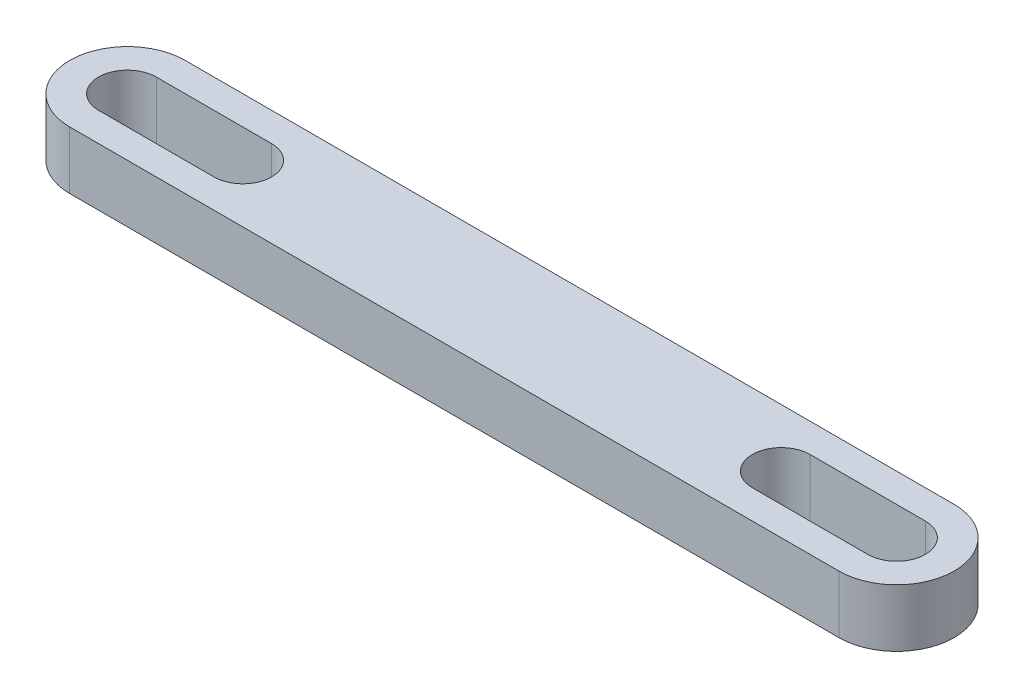
ISO-10303-21;
HEADER;
FILE_DESCRIPTION(('STEP AP214'),'2;1');
FILE_NAME('part.step','',(''),(''),'','','');
FILE_SCHEMA(('AUTOMOTIVE_DESIGN { 1 0 10303 214 1 1 1 1 }'));
ENDSEC;
DATA;
#1=APPLICATION_CONTEXT('core data for automotive mechanical design processes');
#2=APPLICATION_PROTOCOL_DEFINITION('international standard','automotive_design',2000,#1);
#3=PRODUCT_CONTEXT('',#1,'mechanical');
#4=PRODUCT('Part','Part','',(#3));
#5=PRODUCT_RELATED_PRODUCT_CATEGORY('part','',(#4));
#6=PRODUCT_DEFINITION_FORMATION('','',#4);
#7=PRODUCT_DEFINITION_CONTEXT('part definition',#1,'design');
#8=PRODUCT_DEFINITION('design','',#6,#7);
#9=PRODUCT_DEFINITION_SHAPE('','',#8);
#10=(LENGTH_UNIT() NAMED_UNIT(*) SI_UNIT(.MILLI.,.METRE.));
#11=(NAMED_UNIT(*) PLANE_ANGLE_UNIT() SI_UNIT($,.RADIAN.));
#12=(NAMED_UNIT(*) SI_UNIT($,.STERADIAN.) SOLID_ANGLE_UNIT());
#13=UNCERTAINTY_MEASURE_WITH_UNIT(LENGTH_MEASURE(1.E-05),#10,'distance_accuracy_value','');
#14=(GEOMETRIC_REPRESENTATION_CONTEXT(3) GLOBAL_UNCERTAINTY_ASSIGNED_CONTEXT((#13)) GLOBAL_UNIT_ASSIGNED_CONTEXT((#10,
#11,#12)) REPRESENTATION_CONTEXT('',''));
#15=CARTESIAN_POINT('',(0.,0.,0.));
#16=DIRECTION('',(0.,0.,1.));
#17=DIRECTION('',(1.,0.,0.));
#18=AXIS2_PLACEMENT_3D('',#15,#16,#17);
#19=CARTESIAN_POINT('',(0.,3.,-3.));
#20=DIRECTION('',(0.,-1.,0.));
#21=DIRECTION('',(0.,0.,-1.));
#22=AXIS2_PLACEMENT_3D('',#19,#20,#21);
#23=PLANE('',#22);
#24=DIRECTION('',(1.,0.,0.));
#25=VECTOR('',#24,1.);
#26=CARTESIAN_POINT('',(0.,3.,-1.49999999999999));
#27=LINE('',#26,#25);
#28=CARTESIAN_POINT('',(-40.,3.,-1.49999999999999));
#29=VERTEX_POINT('',#28);
#30=CARTESIAN_POINT('',(-34.,3.,-1.49999999999999));
#31=VERTEX_POINT('',#30);
#32=EDGE_CURVE('E206',#29,#31,#27,.T.);
#33=ORIENTED_EDGE('',*,*,#32,.F.);
#34=CARTESIAN_POINT('',(-40.,3.,-3.));
#35=DIRECTION('',(0.,1.,0.));
#36=DIRECTION('',(0.,0.,1.));
#37=AXIS2_PLACEMENT_3D('',#34,#35,#36);
#38=CIRCLE('',#37,1.5);
#39=CARTESIAN_POINT('',(-40.,3.,-4.5));
#40=VERTEX_POINT('',#39);
#41=EDGE_CURVE('E214',#40,#29,#38,.T.);
#42=ORIENTED_EDGE('',*,*,#41,.F.);
#43=DIRECTION('',(1.,0.,0.));
#44=VECTOR('',#43,1.);
#45=CARTESIAN_POINT('',(0.,3.,-4.49999999999998));
#46=LINE('',#45,#44);
#47=CARTESIAN_POINT('',(-34.,3.,-4.5));
#48=VERTEX_POINT('',#47);
#49=EDGE_CURVE('E211',#40,#48,#46,.T.);
#50=ORIENTED_EDGE('',*,*,#49,.T.);
#51=CARTESIAN_POINT('',(-34.,3.,-2.99999999999999));
#52=DIRECTION('',(0.,1.,0.));
#53=DIRECTION('',(0.,0.,1.));
#54=AXIS2_PLACEMENT_3D('',#51,#52,#53);
#55=CIRCLE('',#54,1.5);
#56=EDGE_CURVE('E208',#31,#48,#55,.T.);
#57=ORIENTED_EDGE('',*,*,#56,.F.);
#58=EDGE_LOOP('',(#33,#42,#50,#57));
#59=FACE_BOUND('',#58,.T.);
#60=CARTESIAN_POINT('',(0.,3.,-3.));
#61=DIRECTION('',(0.,-1.,0.));
#62=DIRECTION('',(0.,0.,-1.));
#63=AXIS2_PLACEMENT_3D('',#60,#61,#62);
#64=CIRCLE('',#63,3.);
#65=CARTESIAN_POINT('',(0.,3.,-6.));
#66=VERTEX_POINT('',#65);
#67=CARTESIAN_POINT('',(0.,3.,0.));
#68=VERTEX_POINT('',#67);
#69=EDGE_CURVE('E237',#66,#68,#64,.T.);
#70=ORIENTED_EDGE('',*,*,#69,.F.);
#71=DIRECTION('',(-1.,0.,0.));
#72=VECTOR('',#71,1.);
#73=CARTESIAN_POINT('',(0.,3.,-6.));
#74=LINE('',#73,#72);
#75=CARTESIAN_POINT('',(-40.,3.,-5.99999999999999));
#76=VERTEX_POINT('',#75);
#77=EDGE_CURVE('E246',#66,#76,#74,.T.);
#78=ORIENTED_EDGE('',*,*,#77,.T.);
#79=CARTESIAN_POINT('',(-40.,3.,-3.));
#80=DIRECTION('',(0.,1.,0.));
#81=DIRECTION('',(0.,0.,1.));
#82=AXIS2_PLACEMENT_3D('',#79,#80,#81);
#83=CIRCLE('',#82,3.);
#84=CARTESIAN_POINT('',(-40.,3.,0.));
#85=VERTEX_POINT('',#84);
#86=EDGE_CURVE('E244',#76,#85,#83,.T.);
#87=ORIENTED_EDGE('',*,*,#86,.T.);
#88=DIRECTION('',(-1.,0.,0.));
#89=VECTOR('',#88,1.);
#90=CARTESIAN_POINT('',(0.,3.,0.));
#91=LINE('',#90,#89);
#92=EDGE_CURVE('E240',#68,#85,#91,.T.);
#93=ORIENTED_EDGE('',*,*,#92,.F.);
#94=EDGE_LOOP('',(#70,#78,#87,#93));
#95=FACE_BOUND('',#94,.T.);
#96=DIRECTION('',(-1.,0.,0.));
#97=VECTOR('',#96,1.);
#98=CARTESIAN_POINT('',(0.,3.,-4.5));
#99=LINE('',#98,#97);
#100=CARTESIAN_POINT('',(0.,3.,-4.5));
#101=VERTEX_POINT('',#100);
#102=CARTESIAN_POINT('',(-6.,3.,-4.50000000000001));
#103=VERTEX_POINT('',#102);
#104=EDGE_CURVE('E171',#101,#103,#99,.T.);
#105=ORIENTED_EDGE('',*,*,#104,.F.);
#106=CARTESIAN_POINT('',(0.,3.,-3.));
#107=DIRECTION('',(0.,1.,0.));
#108=DIRECTION('',(0.,0.,1.));
#109=AXIS2_PLACEMENT_3D('',#106,#107,#108);
#110=CIRCLE('',#109,1.5);
#111=CARTESIAN_POINT('',(0.,3.,-1.49999999999999));
#112=VERTEX_POINT('',#111);
#113=EDGE_CURVE('E191',#101,#112,#110,.F.);
#114=ORIENTED_EDGE('',*,*,#113,.T.);
#115=DIRECTION('',(-1.,0.,0.));
#116=VECTOR('',#115,1.);
#117=CARTESIAN_POINT('',(0.,3.,-1.49999999999999));
#118=LINE('',#117,#116);
#119=CARTESIAN_POINT('',(-6.,3.,-1.5));
#120=VERTEX_POINT('',#119);
#121=EDGE_CURVE('E98',#112,#120,#118,.T.);
#122=ORIENTED_EDGE('',*,*,#121,.T.);
#123=CARTESIAN_POINT('',(-6.,3.,-3.00000000000001));
#124=DIRECTION('',(0.,1.,0.));
#125=DIRECTION('',(0.,0.,1.));
#126=AXIS2_PLACEMENT_3D('',#123,#124,#125);
#127=CIRCLE('',#126,1.50000000000001);
#128=EDGE_CURVE('E180',#103,#120,#127,.T.);
#129=ORIENTED_EDGE('',*,*,#128,.F.);
#130=EDGE_LOOP('',(#105,#114,#122,#129));
#131=FACE_BOUND('',#130,.T.);
#132=ADVANCED_FACE('F81',(#59,#95,#131),#23,.F.);
#133=CARTESIAN_POINT('',(0.,0.,-3.));
#134=DIRECTION('',(0.,-1.,0.));
#135=DIRECTION('',(0.,0.,-1.));
#136=AXIS2_PLACEMENT_3D('',#133,#134,#135);
#137=PLANE('',#136);
#138=CARTESIAN_POINT('',(0.,0.,-3.));
#139=DIRECTION('',(0.,-1.,0.));
#140=DIRECTION('',(0.,0.,-1.));
#141=AXIS2_PLACEMENT_3D('',#138,#139,#140);
#142=CIRCLE('',#141,3.);
#143=CARTESIAN_POINT('',(0.,0.,-6.));
#144=VERTEX_POINT('',#143);
#145=CARTESIAN_POINT('',(0.,0.,0.));
#146=VERTEX_POINT('',#145);
#147=EDGE_CURVE('E236',#144,#146,#142,.T.);
#148=ORIENTED_EDGE('',*,*,#147,.T.);
#149=DIRECTION('',(-1.,0.,0.));
#150=VECTOR('',#149,1.);
#151=CARTESIAN_POINT('',(0.,0.,0.));
#152=LINE('',#151,#150);
#153=CARTESIAN_POINT('',(-40.,0.,0.));
#154=VERTEX_POINT('',#153);
#155=EDGE_CURVE('E250',#146,#154,#152,.T.);
#156=ORIENTED_EDGE('',*,*,#155,.T.);
#157=CARTESIAN_POINT('',(-40.,0.,-3.));
#158=DIRECTION('',(0.,1.,0.));
#159=DIRECTION('',(0.,0.,1.));
#160=AXIS2_PLACEMENT_3D('',#157,#158,#159);
#161=CIRCLE('',#160,3.);
#162=CARTESIAN_POINT('',(-40.,0.,-5.99999999999999));
#163=VERTEX_POINT('',#162);
#164=EDGE_CURVE('E253',#163,#154,#161,.T.);
#165=ORIENTED_EDGE('',*,*,#164,.F.);
#166=DIRECTION('',(-1.,0.,0.));
#167=VECTOR('',#166,1.);
#168=CARTESIAN_POINT('',(0.,0.,-6.));
#169=LINE('',#168,#167);
#170=EDGE_CURVE('E241',#144,#163,#169,.T.);
#171=ORIENTED_EDGE('',*,*,#170,.F.);
#172=EDGE_LOOP('',(#148,#156,#165,#171));
#173=FACE_BOUND('',#172,.T.);
#174=CARTESIAN_POINT('',(-40.,0.,-3.));
#175=DIRECTION('',(0.,1.,0.));
#176=DIRECTION('',(0.,0.,1.));
#177=AXIS2_PLACEMENT_3D('',#174,#175,#176);
#178=CIRCLE('',#177,1.5);
#179=CARTESIAN_POINT('',(-40.,0.,-4.5));
#180=VERTEX_POINT('',#179);
#181=CARTESIAN_POINT('',(-40.,0.,-1.49999999999999));
#182=VERTEX_POINT('',#181);
#183=EDGE_CURVE('E209',#180,#182,#178,.T.);
#184=ORIENTED_EDGE('',*,*,#183,.T.);
#185=DIRECTION('',(1.,0.,0.));
#186=VECTOR('',#185,1.);
#187=CARTESIAN_POINT('',(0.,0.,-1.49999999999999));
#188=LINE('',#187,#186);
#189=CARTESIAN_POINT('',(-34.,0.,-1.49999999999999));
#190=VERTEX_POINT('',#189);
#191=EDGE_CURVE('E187',#182,#190,#188,.T.);
#192=ORIENTED_EDGE('',*,*,#191,.T.);
#193=CARTESIAN_POINT('',(-34.,0.,-2.99999999999999));
#194=DIRECTION('',(0.,1.,0.));
#195=DIRECTION('',(0.,0.,1.));
#196=AXIS2_PLACEMENT_3D('',#193,#194,#195);
#197=CIRCLE('',#196,1.5);
#198=CARTESIAN_POINT('',(-34.,0.,-4.5));
#199=VERTEX_POINT('',#198);
#200=EDGE_CURVE('E219',#190,#199,#197,.T.);
#201=ORIENTED_EDGE('',*,*,#200,.T.);
#202=DIRECTION('',(1.,0.,0.));
#203=VECTOR('',#202,1.);
#204=CARTESIAN_POINT('',(0.,0.,-4.49999999999998));
#205=LINE('',#204,#203);
#206=EDGE_CURVE('E222',#180,#199,#205,.T.);
#207=ORIENTED_EDGE('',*,*,#206,.F.);
#208=EDGE_LOOP('',(#184,#192,#201,#207));
#209=FACE_BOUND('',#208,.T.);
#210=CARTESIAN_POINT('',(0.,0.,-3.));
#211=DIRECTION('',(0.,1.,0.));
#212=DIRECTION('',(0.,0.,1.));
#213=AXIS2_PLACEMENT_3D('',#210,#211,#212);
#214=CIRCLE('',#213,1.5);
#215=CARTESIAN_POINT('',(0.,0.,-4.5));
#216=VERTEX_POINT('',#215);
#217=CARTESIAN_POINT('',(0.,0.,-1.49999999999999));
#218=VERTEX_POINT('',#217);
#219=EDGE_CURVE('E181',#216,#218,#214,.F.);
#220=ORIENTED_EDGE('',*,*,#219,.F.);
#221=DIRECTION('',(-1.,0.,0.));
#222=VECTOR('',#221,1.);
#223=CARTESIAN_POINT('',(0.,0.,-4.5));
#224=LINE('',#223,#222);
#225=CARTESIAN_POINT('',(-6.,0.,-4.50000000000001));
#226=VERTEX_POINT('',#225);
#227=EDGE_CURVE('E106',#216,#226,#224,.T.);
#228=ORIENTED_EDGE('',*,*,#227,.T.);
#229=CARTESIAN_POINT('',(-6.,0.,-3.00000000000001));
#230=DIRECTION('',(0.,1.,0.));
#231=DIRECTION('',(0.,0.,1.));
#232=AXIS2_PLACEMENT_3D('',#229,#230,#231);
#233=CIRCLE('',#232,1.50000000000001);
#234=CARTESIAN_POINT('',(-6.,0.,-1.5));
#235=VERTEX_POINT('',#234);
#236=EDGE_CURVE('E186',#226,#235,#233,.T.);
#237=ORIENTED_EDGE('',*,*,#236,.T.);
#238=DIRECTION('',(-1.,0.,0.));
#239=VECTOR('',#238,1.);
#240=CARTESIAN_POINT('',(0.,0.,-1.49999999999999));
#241=LINE('',#240,#239);
#242=EDGE_CURVE('E197',#218,#235,#241,.T.);
#243=ORIENTED_EDGE('',*,*,#242,.F.);
#244=EDGE_LOOP('',(#220,#228,#237,#243));
#245=FACE_BOUND('',#244,.T.);
#246=ADVANCED_FACE('F270',(#173,#209,#245),#137,.T.);
#247=CARTESIAN_POINT('',(0.,3.,-3.));
#248=DIRECTION('',(0.,-1.,0.));
#249=DIRECTION('',(0.,0.,-1.));
#250=AXIS2_PLACEMENT_3D('',#247,#248,#249);
#251=CYLINDRICAL_SURFACE('',#250,3.);
#252=ORIENTED_EDGE('',*,*,#147,.F.);
#253=DIRECTION('',(0.,-1.,0.));
#254=VECTOR('',#253,1.);
#255=CARTESIAN_POINT('',(0.,3.,-6.));
#256=LINE('',#255,#254);
#257=EDGE_CURVE('E12',#66,#144,#256,.T.);
#258=ORIENTED_EDGE('',*,*,#257,.F.);
#259=ORIENTED_EDGE('',*,*,#69,.T.);
#260=DIRECTION('',(0.,-1.,0.));
#261=VECTOR('',#260,1.);
#262=CARTESIAN_POINT('',(0.,3.,0.));
#263=LINE('',#262,#261);
#264=EDGE_CURVE('E85',#68,#146,#263,.T.);
#265=ORIENTED_EDGE('',*,*,#264,.T.);
#266=EDGE_LOOP('',(#252,#258,#259,#265));
#267=FACE_BOUND('',#266,.T.);
#268=ADVANCED_FACE('F83',(#267),#251,.T.);
#269=CARTESIAN_POINT('',(0.,3.,-6.));
#270=DIRECTION('',(0.,0.,1.));
#271=DIRECTION('',(1.,0.,0.));
#272=AXIS2_PLACEMENT_3D('',#269,#270,#271);
#273=PLANE('',#272);
#274=ORIENTED_EDGE('',*,*,#170,.T.);
#275=DIRECTION('',(0.,-1.,0.));
#276=VECTOR('',#275,1.);
#277=CARTESIAN_POINT('',(-40.,3.,-5.99999999999999));
#278=LINE('',#277,#276);
#279=EDGE_CURVE('E90',#76,#163,#278,.T.);
#280=ORIENTED_EDGE('',*,*,#279,.F.);
#281=ORIENTED_EDGE('',*,*,#77,.F.);
#282=ORIENTED_EDGE('',*,*,#257,.T.);
#283=EDGE_LOOP('',(#274,#280,#281,#282));
#284=FACE_BOUND('',#283,.T.);
#285=ADVANCED_FACE('F274',(#284),#273,.F.);
#286=CARTESIAN_POINT('',(-40.,3.,-3.));
#287=DIRECTION('',(0.,-1.,0.));
#288=DIRECTION('',(0.,0.,-1.));
#289=AXIS2_PLACEMENT_3D('',#286,#287,#288);
#290=CYLINDRICAL_SURFACE('',#289,3.);
#291=ORIENTED_EDGE('',*,*,#164,.T.);
#292=DIRECTION('',(0.,-1.,0.));
#293=VECTOR('',#292,1.);
#294=CARTESIAN_POINT('',(-40.,3.,0.));
#295=LINE('',#294,#293);
#296=EDGE_CURVE('E258',#85,#154,#295,.T.);
#297=ORIENTED_EDGE('',*,*,#296,.F.);
#298=ORIENTED_EDGE('',*,*,#86,.F.);
#299=ORIENTED_EDGE('',*,*,#279,.T.);
#300=EDGE_LOOP('',(#291,#297,#298,#299));
#301=FACE_BOUND('',#300,.T.);
#302=ADVANCED_FACE('F278',(#301),#290,.T.);
#303=CARTESIAN_POINT('',(0.,3.,0.));
#304=DIRECTION('',(0.,0.,1.));
#305=DIRECTION('',(1.,0.,0.));
#306=AXIS2_PLACEMENT_3D('',#303,#304,#305);
#307=PLANE('',#306);
#308=ORIENTED_EDGE('',*,*,#155,.F.);
#309=ORIENTED_EDGE('',*,*,#264,.F.);
#310=ORIENTED_EDGE('',*,*,#92,.T.);
#311=ORIENTED_EDGE('',*,*,#296,.T.);
#312=EDGE_LOOP('',(#308,#309,#310,#311));
#313=FACE_BOUND('',#312,.T.);
#314=ADVANCED_FACE('F266',(#313),#307,.T.);
#315=CARTESIAN_POINT('',(0.,3.,-1.49999999999999));
#316=DIRECTION('',(0.,0.,-1.));
#317=DIRECTION('',(-1.,0.,0.));
#318=AXIS2_PLACEMENT_3D('',#315,#316,#317);
#319=PLANE('',#318);
#320=ORIENTED_EDGE('',*,*,#191,.F.);
#321=DIRECTION('',(0.,-1.,0.));
#322=VECTOR('',#321,1.);
#323=CARTESIAN_POINT('',(-40.,3.,-1.49999999999999));
#324=LINE('',#323,#322);
#325=EDGE_CURVE('E216',#29,#182,#324,.T.);
#326=ORIENTED_EDGE('',*,*,#325,.F.);
#327=ORIENTED_EDGE('',*,*,#32,.T.);
#328=DIRECTION('',(0.,-1.,0.));
#329=VECTOR('',#328,1.);
#330=CARTESIAN_POINT('',(-34.,3.,-1.49999999999999));
#331=LINE('',#330,#329);
#332=EDGE_CURVE('E233',#31,#190,#331,.T.);
#333=ORIENTED_EDGE('',*,*,#332,.T.);
#334=EDGE_LOOP('',(#320,#326,#327,#333));
#335=FACE_BOUND('',#334,.T.);
#336=ADVANCED_FACE('F289',(#335),#319,.T.);
#337=CARTESIAN_POINT('',(-34.,3.,-2.99999999999999));
#338=DIRECTION('',(0.,-1.,0.));
#339=DIRECTION('',(0.,0.,-1.));
#340=AXIS2_PLACEMENT_3D('',#337,#338,#339);
#341=CYLINDRICAL_SURFACE('',#340,1.5);
#342=ORIENTED_EDGE('',*,*,#200,.F.);
#343=ORIENTED_EDGE('',*,*,#332,.F.);
#344=ORIENTED_EDGE('',*,*,#56,.T.);
#345=DIRECTION('',(0.,-1.,0.));
#346=VECTOR('',#345,1.);
#347=CARTESIAN_POINT('',(-34.,3.,-4.5));
#348=LINE('',#347,#346);
#349=EDGE_CURVE('E231',#48,#199,#348,.T.);
#350=ORIENTED_EDGE('',*,*,#349,.T.);
#351=EDGE_LOOP('',(#342,#343,#344,#350));
#352=FACE_BOUND('',#351,.T.);
#353=ADVANCED_FACE('F299',(#352),#341,.F.);
#354=CARTESIAN_POINT('',(0.,3.,-4.49999999999998));
#355=DIRECTION('',(0.,0.,-1.));
#356=DIRECTION('',(-1.,0.,0.));
#357=AXIS2_PLACEMENT_3D('',#354,#355,#356);
#358=PLANE('',#357);
#359=ORIENTED_EDGE('',*,*,#206,.T.);
#360=ORIENTED_EDGE('',*,*,#349,.F.);
#361=ORIENTED_EDGE('',*,*,#49,.F.);
#362=DIRECTION('',(0.,-1.,0.));
#363=VECTOR('',#362,1.);
#364=CARTESIAN_POINT('',(-40.,3.,-4.5));
#365=LINE('',#364,#363);
#366=EDGE_CURVE('E229',#40,#180,#365,.T.);
#367=ORIENTED_EDGE('',*,*,#366,.T.);
#368=EDGE_LOOP('',(#359,#360,#361,#367));
#369=FACE_BOUND('',#368,.T.);
#370=ADVANCED_FACE('F304',(#369),#358,.F.);
#371=CARTESIAN_POINT('',(-40.,3.,-3.));
#372=DIRECTION('',(0.,-1.,0.));
#373=DIRECTION('',(0.,0.,-1.));
#374=AXIS2_PLACEMENT_3D('',#371,#372,#373);
#375=CYLINDRICAL_SURFACE('',#374,1.5);
#376=ORIENTED_EDGE('',*,*,#183,.F.);
#377=ORIENTED_EDGE('',*,*,#366,.F.);
#378=ORIENTED_EDGE('',*,*,#41,.T.);
#379=ORIENTED_EDGE('',*,*,#325,.T.);
#380=EDGE_LOOP('',(#376,#377,#378,#379));
#381=FACE_BOUND('',#380,.T.);
#382=ADVANCED_FACE('F310',(#381),#375,.F.);
#383=CARTESIAN_POINT('',(0.,3.,-4.5));
#384=DIRECTION('',(0.,0.,1.));
#385=DIRECTION('',(1.,0.,0.));
#386=AXIS2_PLACEMENT_3D('',#383,#384,#385);
#387=PLANE('',#386);
#388=ORIENTED_EDGE('',*,*,#227,.F.);
#389=DIRECTION('',(0.,-1.,0.));
#390=VECTOR('',#389,1.);
#391=CARTESIAN_POINT('',(0.,3.,-4.5));
#392=LINE('',#391,#390);
#393=EDGE_CURVE('E175',#101,#216,#392,.T.);
#394=ORIENTED_EDGE('',*,*,#393,.F.);
#395=ORIENTED_EDGE('',*,*,#104,.T.);
#396=DIRECTION('',(0.,-1.,0.));
#397=VECTOR('',#396,1.);
#398=CARTESIAN_POINT('',(-6.,3.,-4.50000000000001));
#399=LINE('',#398,#397);
#400=EDGE_CURVE('E174',#103,#226,#399,.T.);
#401=ORIENTED_EDGE('',*,*,#400,.T.);
#402=EDGE_LOOP('',(#388,#394,#395,#401));
#403=FACE_BOUND('',#402,.T.);
#404=ADVANCED_FACE('F173',(#403),#387,.T.);
#405=CARTESIAN_POINT('',(-6.,3.,-3.00000000000001));
#406=DIRECTION('',(0.,-1.,0.));
#407=DIRECTION('',(0.,0.,-1.));
#408=AXIS2_PLACEMENT_3D('',#405,#406,#407);
#409=CYLINDRICAL_SURFACE('',#408,1.50000000000001);
#410=ORIENTED_EDGE('',*,*,#236,.F.);
#411=ORIENTED_EDGE('',*,*,#400,.F.);
#412=ORIENTED_EDGE('',*,*,#128,.T.);
#413=DIRECTION('',(0.,-1.,0.));
#414=VECTOR('',#413,1.);
#415=CARTESIAN_POINT('',(-6.,3.,-1.5));
#416=LINE('',#415,#414);
#417=EDGE_CURVE('E188',#120,#235,#416,.T.);
#418=ORIENTED_EDGE('',*,*,#417,.T.);
#419=EDGE_LOOP('',(#410,#411,#412,#418));
#420=FACE_BOUND('',#419,.T.);
#421=ADVANCED_FACE('F184',(#420),#409,.F.);
#422=CARTESIAN_POINT('',(0.,3.,-1.49999999999999));
#423=DIRECTION('',(0.,0.,1.));
#424=DIRECTION('',(1.,0.,0.));
#425=AXIS2_PLACEMENT_3D('',#422,#423,#424);
#426=PLANE('',#425);
#427=ORIENTED_EDGE('',*,*,#242,.T.);
#428=ORIENTED_EDGE('',*,*,#417,.F.);
#429=ORIENTED_EDGE('',*,*,#121,.F.);
#430=DIRECTION('',(0.,-1.,0.));
#431=VECTOR('',#430,1.);
#432=CARTESIAN_POINT('',(0.,3.,-1.49999999999999));
#433=LINE('',#432,#431);
#434=EDGE_CURVE('E203',#112,#218,#433,.T.);
#435=ORIENTED_EDGE('',*,*,#434,.T.);
#436=EDGE_LOOP('',(#427,#428,#429,#435));
#437=FACE_BOUND('',#436,.T.);
#438=ADVANCED_FACE('F329',(#437),#426,.F.);
#439=CARTESIAN_POINT('',(0.,3.,-3.));
#440=DIRECTION('',(0.,-1.,0.));
#441=DIRECTION('',(0.,0.,-1.));
#442=AXIS2_PLACEMENT_3D('',#439,#440,#441);
#443=CYLINDRICAL_SURFACE('',#442,1.5);
#444=ORIENTED_EDGE('',*,*,#219,.T.);
#445=ORIENTED_EDGE('',*,*,#434,.F.);
#446=ORIENTED_EDGE('',*,*,#113,.F.);
#447=ORIENTED_EDGE('',*,*,#393,.T.);
#448=EDGE_LOOP('',(#444,#445,#446,#447));
#449=FACE_BOUND('',#448,.T.);
#450=ADVANCED_FACE('F332',(#449),#443,.F.);
#451=CLOSED_SHELL('',(#132,#246,#268,#285,#302,#314,#336,#353,#370,#382,#404,#421,#438,#450));
#452=MANIFOLD_SOLID_BREP('B2',#451);
#453=ADVANCED_BREP_SHAPE_REPRESENTATION('',(#18,#452),#14);
#454=SHAPE_DEFINITION_REPRESENTATION(#9,#453);
ENDSEC;
END-ISO-10303-21;
